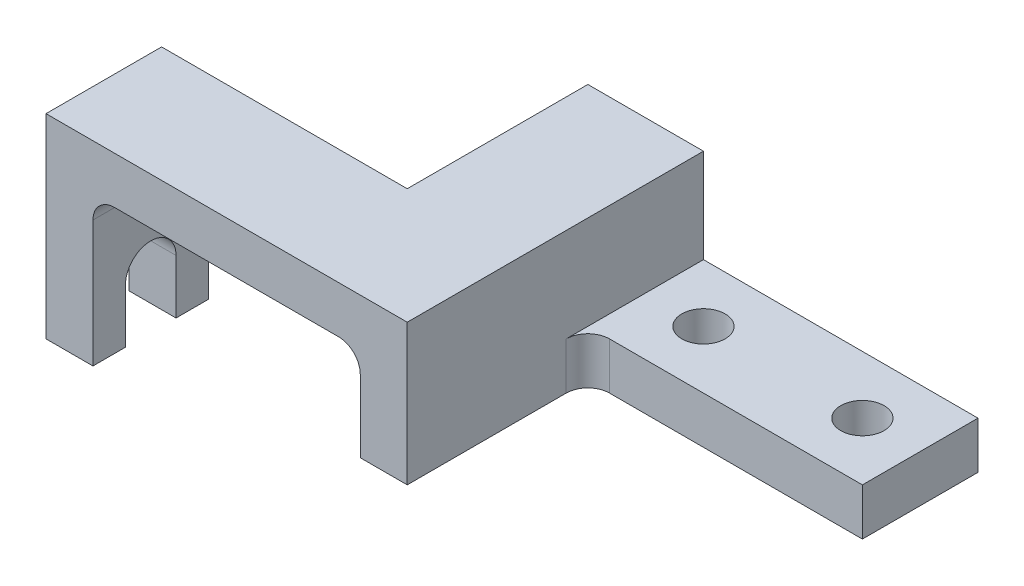
ISO-10303-21;
HEADER;
FILE_DESCRIPTION(('STEP AP214'),'2;1');
FILE_NAME('part.step','',(''),(''),'','','');
FILE_SCHEMA(('AUTOMOTIVE_DESIGN { 1 0 10303 214 1 1 1 1 }'));
ENDSEC;
DATA;
#1=APPLICATION_CONTEXT('core data for automotive mechanical design processes');
#2=APPLICATION_PROTOCOL_DEFINITION('international standard','automotive_design',2000,#1);
#3=PRODUCT_CONTEXT('',#1,'mechanical');
#4=PRODUCT('Part','Part','',(#3));
#5=PRODUCT_RELATED_PRODUCT_CATEGORY('part','',(#4));
#6=PRODUCT_DEFINITION_FORMATION('','',#4);
#7=PRODUCT_DEFINITION_CONTEXT('part definition',#1,'design');
#8=PRODUCT_DEFINITION('design','',#6,#7);
#9=PRODUCT_DEFINITION_SHAPE('','',#8);
#10=(LENGTH_UNIT() NAMED_UNIT(*) SI_UNIT(.MILLI.,.METRE.));
#11=(NAMED_UNIT(*) PLANE_ANGLE_UNIT() SI_UNIT($,.RADIAN.));
#12=(NAMED_UNIT(*) SI_UNIT($,.STERADIAN.) SOLID_ANGLE_UNIT());
#13=UNCERTAINTY_MEASURE_WITH_UNIT(LENGTH_MEASURE(1.E-05),#10,'distance_accuracy_value','');
#14=(GEOMETRIC_REPRESENTATION_CONTEXT(3) GLOBAL_UNCERTAINTY_ASSIGNED_CONTEXT((#13)) GLOBAL_UNIT_ASSIGNED_CONTEXT((#10,
#11,#12)) REPRESENTATION_CONTEXT('',''));
#15=CARTESIAN_POINT('',(0.,0.,0.));
#16=DIRECTION('',(0.,0.,1.));
#17=DIRECTION('',(1.,0.,0.));
#18=AXIS2_PLACEMENT_3D('',#15,#16,#17);
#19=CARTESIAN_POINT('',(-138.,0.,0.));
#20=DIRECTION('',(-1.,0.,0.));
#21=DIRECTION('',(0.,0.,1.));
#22=AXIS2_PLACEMENT_3D('',#19,#20,#21);
#23=PLANE('',#22);
#24=CARTESIAN_POINT('',(-138.,0.,50.));
#25=DIRECTION('',(-1.,0.,0.));
#26=DIRECTION('',(0.,0.,1.));
#27=AXIS2_PLACEMENT_3D('',#24,#25,#26);
#28=CIRCLE('',#27,7.);
#29=CARTESIAN_POINT('',(-138.,0.,57.));
#30=VERTEX_POINT('',#29);
#31=CARTESIAN_POINT('',(-138.,0.,43.));
#32=VERTEX_POINT('',#31);
#33=EDGE_CURVE('E43',#30,#32,#28,.T.);
#34=ORIENTED_EDGE('',*,*,#33,.F.);
#35=DIRECTION('',(0.,-1.,0.));
#36=VECTOR('',#35,1.);
#37=CARTESIAN_POINT('',(-138.,0.,57.));
#38=LINE('',#37,#36);
#39=CARTESIAN_POINT('',(-138.,-15.,57.));
#40=VERTEX_POINT('',#39);
#41=EDGE_CURVE('E71',#30,#40,#38,.T.);
#42=ORIENTED_EDGE('',*,*,#41,.T.);
#43=DIRECTION('',(0.,0.,-1.));
#44=VECTOR('',#43,1.);
#45=CARTESIAN_POINT('',(-138.,-15.,66.));
#46=LINE('',#45,#44);
#47=CARTESIAN_POINT('',(-138.,-15.,66.));
#48=VERTEX_POINT('',#47);
#49=EDGE_CURVE('E322',#48,#40,#46,.T.);
#50=ORIENTED_EDGE('',*,*,#49,.F.);
#51=DIRECTION('',(0.,1.,0.));
#52=VECTOR('',#51,1.);
#53=CARTESIAN_POINT('',(-138.,39.,66.));
#54=LINE('',#53,#52);
#55=CARTESIAN_POINT('',(-138.,39.,66.));
#56=VERTEX_POINT('',#55);
#57=EDGE_CURVE('E290',#48,#56,#54,.T.);
#58=ORIENTED_EDGE('',*,*,#57,.T.);
#59=DIRECTION('',(0.,0.,-1.));
#60=VECTOR('',#59,1.);
#61=CARTESIAN_POINT('',(-138.,39.,-16.));
#62=LINE('',#61,#60);
#63=CARTESIAN_POINT('',(-138.,39.,34.));
#64=VERTEX_POINT('',#63);
#65=EDGE_CURVE('E287',#56,#64,#62,.T.);
#66=ORIENTED_EDGE('',*,*,#65,.T.);
#67=DIRECTION('',(0.,1.,0.));
#68=VECTOR('',#67,1.);
#69=CARTESIAN_POINT('',(-138.,0.,34.));
#70=LINE('',#69,#68);
#71=CARTESIAN_POINT('',(-138.,-15.,34.));
#72=VERTEX_POINT('',#71);
#73=EDGE_CURVE('E228',#72,#64,#70,.T.);
#74=ORIENTED_EDGE('',*,*,#73,.F.);
#75=CARTESIAN_POINT('',(-138.,-15.,43.));
#76=VERTEX_POINT('',#75);
#77=EDGE_CURVE('E325',#76,#72,#46,.T.);
#78=ORIENTED_EDGE('',*,*,#77,.F.);
#79=DIRECTION('',(0.,1.,0.));
#80=VECTOR('',#79,1.);
#81=CARTESIAN_POINT('',(-138.,0.,43.));
#82=LINE('',#81,#80);
#83=EDGE_CURVE('E57',#76,#32,#82,.T.);
#84=ORIENTED_EDGE('',*,*,#83,.T.);
#85=EDGE_LOOP('',(#34,#42,#50,#58,#66,#74,#78,#84));
#86=FACE_BOUND('',#85,.T.);
#87=ADVANCED_FACE('F39',(#86),#23,.T.);
#88=CARTESIAN_POINT('',(-125.,-15.,66.));
#89=DIRECTION('',(-1.,0.,0.));
#90=DIRECTION('',(0.,0.,1.));
#91=AXIS2_PLACEMENT_3D('',#88,#89,#90);
#92=PLANE('',#91);
#93=DIRECTION('',(0.,-1.,0.));
#94=VECTOR('',#93,1.);
#95=CARTESIAN_POINT('',(-125.,0.,57.));
#96=LINE('',#95,#94);
#97=CARTESIAN_POINT('',(-125.,0.,57.));
#98=VERTEX_POINT('',#97);
#99=CARTESIAN_POINT('',(-125.,-15.,57.));
#100=VERTEX_POINT('',#99);
#101=EDGE_CURVE('E328',#98,#100,#96,.T.);
#102=ORIENTED_EDGE('',*,*,#101,.F.);
#103=CARTESIAN_POINT('',(-125.,0.,50.));
#104=DIRECTION('',(-1.,0.,0.));
#105=DIRECTION('',(0.,0.,1.));
#106=AXIS2_PLACEMENT_3D('',#103,#104,#105);
#107=CIRCLE('',#106,7.);
#108=CARTESIAN_POINT('',(-125.,0.,43.));
#109=VERTEX_POINT('',#108);
#110=EDGE_CURVE('E337',#109,#98,#107,.F.);
#111=ORIENTED_EDGE('',*,*,#110,.F.);
#112=DIRECTION('',(0.,1.,0.));
#113=VECTOR('',#112,1.);
#114=CARTESIAN_POINT('',(-125.,0.,43.));
#115=LINE('',#114,#113);
#116=CARTESIAN_POINT('',(-125.,-15.,43.));
#117=VERTEX_POINT('',#116);
#118=EDGE_CURVE('E333',#117,#109,#115,.T.);
#119=ORIENTED_EDGE('',*,*,#118,.F.);
#120=DIRECTION('',(0.,0.,1.));
#121=VECTOR('',#120,1.);
#122=CARTESIAN_POINT('',(-125.,-15.,66.));
#123=LINE('',#122,#121);
#124=CARTESIAN_POINT('',(-125.,-15.,34.));
#125=VERTEX_POINT('',#124);
#126=EDGE_CURVE('E316',#125,#117,#123,.T.);
#127=ORIENTED_EDGE('',*,*,#126,.F.);
#128=DIRECTION('',(0.,1.,0.));
#129=VECTOR('',#128,1.);
#130=CARTESIAN_POINT('',(-125.,-15.,34.));
#131=LINE('',#130,#129);
#132=CARTESIAN_POINT('',(-125.,20.,34.));
#133=VERTEX_POINT('',#132);
#134=EDGE_CURVE('E305',#125,#133,#131,.T.);
#135=ORIENTED_EDGE('',*,*,#134,.T.);
#136=DIRECTION('',(0.,0.,1.));
#137=VECTOR('',#136,1.);
#138=CARTESIAN_POINT('',(-125.,20.,66.));
#139=LINE('',#138,#137);
#140=CARTESIAN_POINT('',(-125.,20.,66.));
#141=VERTEX_POINT('',#140);
#142=EDGE_CURVE('E216',#133,#141,#139,.T.);
#143=ORIENTED_EDGE('',*,*,#142,.T.);
#144=DIRECTION('',(0.,1.,0.));
#145=VECTOR('',#144,1.);
#146=CARTESIAN_POINT('',(-125.,-15.,66.));
#147=LINE('',#146,#145);
#148=CARTESIAN_POINT('',(-125.,-15.,66.));
#149=VERTEX_POINT('',#148);
#150=EDGE_CURVE('E310',#149,#141,#147,.T.);
#151=ORIENTED_EDGE('',*,*,#150,.F.);
#152=EDGE_CURVE('E319',#100,#149,#123,.T.);
#153=ORIENTED_EDGE('',*,*,#152,.F.);
#154=EDGE_LOOP('',(#102,#111,#119,#127,#135,#143,#151,#153));
#155=FACE_BOUND('',#154,.T.);
#156=ADVANCED_FACE('F347',(#155),#92,.F.);
#157=CARTESIAN_POINT('',(0.,-15.,0.));
#158=DIRECTION('',(0.,-1.,0.));
#159=DIRECTION('',(0.,0.,-1.));
#160=AXIS2_PLACEMENT_3D('',#157,#158,#159);
#161=PLANE('',#160);
#162=ORIENTED_EDGE('',*,*,#49,.T.);
#163=DIRECTION('',(1.,0.,0.));
#164=VECTOR('',#163,1.);
#165=CARTESIAN_POINT('',(0.,-15.,57.));
#166=LINE('',#165,#164);
#167=EDGE_CURVE('E11',#40,#100,#166,.T.);
#168=ORIENTED_EDGE('',*,*,#167,.T.);
#169=ORIENTED_EDGE('',*,*,#152,.T.);
#170=DIRECTION('',(-1.,0.,0.));
#171=VECTOR('',#170,1.);
#172=CARTESIAN_POINT('',(-138.,-15.,66.));
#173=LINE('',#172,#171);
#174=EDGE_CURVE('E313',#149,#48,#173,.T.);
#175=ORIENTED_EDGE('',*,*,#174,.T.);
#176=EDGE_LOOP('',(#162,#168,#169,#175));
#177=FACE_BOUND('',#176,.T.);
#178=ADVANCED_FACE('F353',(#177),#161,.T.);
#179=ORIENTED_EDGE('',*,*,#126,.T.);
#180=DIRECTION('',(-1.,0.,0.));
#181=VECTOR('',#180,1.);
#182=CARTESIAN_POINT('',(0.,-15.,43.));
#183=LINE('',#182,#181);
#184=EDGE_CURVE('E49',#117,#76,#183,.T.);
#185=ORIENTED_EDGE('',*,*,#184,.T.);
#186=ORIENTED_EDGE('',*,*,#77,.T.);
#187=DIRECTION('',(1.,0.,0.));
#188=VECTOR('',#187,1.);
#189=CARTESIAN_POINT('',(-138.,-15.,34.));
#190=LINE('',#189,#188);
#191=EDGE_CURVE('E320',#72,#125,#190,.T.);
#192=ORIENTED_EDGE('',*,*,#191,.T.);
#193=EDGE_LOOP('',(#179,#185,#186,#192));
#194=FACE_BOUND('',#193,.T.);
#195=ADVANCED_FACE('F361',(#194),#161,.T.);
#196=CARTESIAN_POINT('',(-138.,26.,-16.));
#197=DIRECTION('',(0.,1.,0.));
#198=DIRECTION('',(0.,0.,1.));
#199=AXIS2_PLACEMENT_3D('',#196,#197,#198);
#200=PLANE('',#199);
#201=DIRECTION('',(1.,0.,0.));
#202=VECTOR('',#201,1.);
#203=CARTESIAN_POINT('',(-138.,26.,66.));
#204=LINE('',#203,#202);
#205=CARTESIAN_POINT('',(-119.,26.,66.));
#206=VERTEX_POINT('',#205);
#207=CARTESIAN_POINT('',(-57.,26.,66.));
#208=VERTEX_POINT('',#207);
#209=EDGE_CURVE('E284',#206,#208,#204,.T.);
#210=ORIENTED_EDGE('',*,*,#209,.F.);
#211=DIRECTION('',(0.,0.,1.));
#212=VECTOR('',#211,1.);
#213=CARTESIAN_POINT('',(-119.,26.,34.));
#214=LINE('',#213,#212);
#215=CARTESIAN_POINT('',(-119.,26.,34.));
#216=VERTEX_POINT('',#215);
#217=EDGE_CURVE('E186',#206,#216,#214,.F.);
#218=ORIENTED_EDGE('',*,*,#217,.T.);
#219=DIRECTION('',(1.,0.,0.));
#220=VECTOR('',#219,1.);
#221=CARTESIAN_POINT('',(-138.,26.,34.));
#222=LINE('',#221,#220);
#223=CARTESIAN_POINT('',(-70.,26.,34.));
#224=VERTEX_POINT('',#223);
#225=EDGE_CURVE('E299',#216,#224,#222,.T.);
#226=ORIENTED_EDGE('',*,*,#225,.T.);
#227=DIRECTION('',(0.,0.,-1.));
#228=VECTOR('',#227,1.);
#229=CARTESIAN_POINT('',(-70.,26.,-16.));
#230=LINE('',#229,#228);
#231=CARTESIAN_POINT('',(-70.,26.,-16.));
#232=VERTEX_POINT('',#231);
#233=EDGE_CURVE('E225',#224,#232,#230,.T.);
#234=ORIENTED_EDGE('',*,*,#233,.T.);
#235=DIRECTION('',(1.,0.,0.));
#236=VECTOR('',#235,1.);
#237=CARTESIAN_POINT('',(-138.,26.,-16.));
#238=LINE('',#237,#236);
#239=CARTESIAN_POINT('',(-57.,26.,-16.));
#240=VERTEX_POINT('',#239);
#241=EDGE_CURVE('E280',#232,#240,#238,.T.);
#242=ORIENTED_EDGE('',*,*,#241,.T.);
#243=DIRECTION('',(0.,0.,1.));
#244=VECTOR('',#243,1.);
#245=CARTESIAN_POINT('',(-57.,26.,66.));
#246=LINE('',#245,#244);
#247=EDGE_CURVE('E201',#240,#208,#246,.T.);
#248=ORIENTED_EDGE('',*,*,#247,.T.);
#249=EDGE_LOOP('',(#210,#218,#226,#234,#242,#248));
#250=FACE_BOUND('',#249,.T.);
#251=ADVANCED_FACE('F390',(#250),#200,.F.);
#252=CARTESIAN_POINT('',(-51.,0.,0.));
#253=DIRECTION('',(1.,0.,0.));
#254=DIRECTION('',(0.,0.,-1.));
#255=AXIS2_PLACEMENT_3D('',#252,#253,#254);
#256=PLANE('',#255);
#257=DIRECTION('',(0.,1.,0.));
#258=VECTOR('',#257,1.);
#259=CARTESIAN_POINT('',(-51.,0.,66.));
#260=LINE('',#259,#258);
#261=CARTESIAN_POINT('',(-51.,0.,66.));
#262=VERTEX_POINT('',#261);
#263=CARTESIAN_POINT('',(-51.,20.,66.));
#264=VERTEX_POINT('',#263);
#265=EDGE_CURVE('E182',#262,#264,#260,.T.);
#266=ORIENTED_EDGE('',*,*,#265,.T.);
#267=DIRECTION('',(0.,0.,1.));
#268=VECTOR('',#267,1.);
#269=CARTESIAN_POINT('',(-51.,20.,-16.));
#270=LINE('',#269,#268);
#271=CARTESIAN_POINT('',(-51.,20.,-16.));
#272=VERTEX_POINT('',#271);
#273=EDGE_CURVE('E176',#264,#272,#270,.F.);
#274=ORIENTED_EDGE('',*,*,#273,.T.);
#275=DIRECTION('',(0.,-1.,0.));
#276=VECTOR('',#275,1.);
#277=CARTESIAN_POINT('',(-51.,0.,-16.));
#278=LINE('',#277,#276);
#279=CARTESIAN_POINT('',(-51.,0.,-16.));
#280=VERTEX_POINT('',#279);
#281=EDGE_CURVE('E179',#272,#280,#278,.T.);
#282=ORIENTED_EDGE('',*,*,#281,.T.);
#283=DIRECTION('',(0.,0.,1.));
#284=VECTOR('',#283,1.);
#285=CARTESIAN_POINT('',(-51.,0.,-16.));
#286=LINE('',#285,#284);
#287=EDGE_CURVE('E196',#280,#262,#286,.T.);
#288=ORIENTED_EDGE('',*,*,#287,.T.);
#289=EDGE_LOOP('',(#266,#274,#282,#288));
#290=FACE_BOUND('',#289,.T.);
#291=ADVANCED_FACE('F178',(#290),#256,.F.);
#292=CARTESIAN_POINT('',(38.,13.,16.));
#293=DIRECTION('',(-1.,0.,0.));
#294=DIRECTION('',(0.,0.,1.));
#295=AXIS2_PLACEMENT_3D('',#292,#293,#294);
#296=PLANE('',#295);
#297=DIRECTION('',(0.,0.,-1.));
#298=VECTOR('',#297,1.);
#299=CARTESIAN_POINT('',(38.,0.,16.));
#300=LINE('',#299,#298);
#301=CARTESIAN_POINT('',(38.,0.,16.));
#302=VERTEX_POINT('',#301);
#303=CARTESIAN_POINT('',(38.,0.,-16.));
#304=VERTEX_POINT('',#303);
#305=EDGE_CURVE('E240',#302,#304,#300,.T.);
#306=ORIENTED_EDGE('',*,*,#305,.T.);
#307=DIRECTION('',(0.,-1.,0.));
#308=VECTOR('',#307,1.);
#309=CARTESIAN_POINT('',(38.,13.,-16.));
#310=LINE('',#309,#308);
#311=CARTESIAN_POINT('',(38.,13.,-16.));
#312=VERTEX_POINT('',#311);
#313=EDGE_CURVE('E230',#312,#304,#310,.T.);
#314=ORIENTED_EDGE('',*,*,#313,.F.);
#315=DIRECTION('',(0.,0.,-1.));
#316=VECTOR('',#315,1.);
#317=CARTESIAN_POINT('',(38.,13.,16.));
#318=LINE('',#317,#316);
#319=CARTESIAN_POINT('',(38.,13.,16.));
#320=VERTEX_POINT('',#319);
#321=EDGE_CURVE('E238',#320,#312,#318,.T.);
#322=ORIENTED_EDGE('',*,*,#321,.F.);
#323=DIRECTION('',(0.,-1.,0.));
#324=VECTOR('',#323,1.);
#325=CARTESIAN_POINT('',(38.,13.,16.));
#326=LINE('',#325,#324);
#327=EDGE_CURVE('E232',#320,#302,#326,.T.);
#328=ORIENTED_EDGE('',*,*,#327,.T.);
#329=EDGE_LOOP('',(#306,#314,#322,#328));
#330=FACE_BOUND('',#329,.T.);
#331=ADVANCED_FACE('F396',(#330),#296,.F.);
#332=CARTESIAN_POINT('',(-38.,13.,-16.));
#333=DIRECTION('',(0.,0.,1.));
#334=DIRECTION('',(1.,0.,0.));
#335=AXIS2_PLACEMENT_3D('',#332,#333,#334);
#336=PLANE('',#335);
#337=ORIENTED_EDGE('',*,*,#241,.F.);
#338=DIRECTION('',(0.,1.,0.));
#339=VECTOR('',#338,1.);
#340=CARTESIAN_POINT('',(-70.,0.,-16.));
#341=LINE('',#340,#339);
#342=CARTESIAN_POINT('',(-70.,39.,-16.));
#343=VERTEX_POINT('',#342);
#344=EDGE_CURVE('E301',#232,#343,#341,.T.);
#345=ORIENTED_EDGE('',*,*,#344,.T.);
#346=DIRECTION('',(1.,0.,0.));
#347=VECTOR('',#346,1.);
#348=CARTESIAN_POINT('',(-51.,39.,-16.));
#349=LINE('',#348,#347);
#350=CARTESIAN_POINT('',(-38.,39.,-16.));
#351=VERTEX_POINT('',#350);
#352=EDGE_CURVE('E269',#343,#351,#349,.T.);
#353=ORIENTED_EDGE('',*,*,#352,.T.);
#354=DIRECTION('',(0.,-1.,0.));
#355=VECTOR('',#354,1.);
#356=CARTESIAN_POINT('',(-38.,0.,-16.));
#357=LINE('',#356,#355);
#358=CARTESIAN_POINT('',(-38.,13.,-16.));
#359=VERTEX_POINT('',#358);
#360=EDGE_CURVE('E277',#351,#359,#357,.T.);
#361=ORIENTED_EDGE('',*,*,#360,.T.);
#362=DIRECTION('',(-1.,0.,0.));
#363=VECTOR('',#362,1.);
#364=CARTESIAN_POINT('',(-38.,13.,-16.));
#365=LINE('',#364,#363);
#366=EDGE_CURVE('E247',#312,#359,#365,.T.);
#367=ORIENTED_EDGE('',*,*,#366,.F.);
#368=ORIENTED_EDGE('',*,*,#313,.T.);
#369=DIRECTION('',(-1.,0.,0.));
#370=VECTOR('',#369,1.);
#371=CARTESIAN_POINT('',(-38.,0.,-16.));
#372=LINE('',#371,#370);
#373=EDGE_CURVE('E194',#304,#280,#372,.T.);
#374=ORIENTED_EDGE('',*,*,#373,.T.);
#375=ORIENTED_EDGE('',*,*,#281,.F.);
#376=CARTESIAN_POINT('',(-57.,20.,-16.));
#377=DIRECTION('',(0.,0.,1.));
#378=DIRECTION('',(1.,0.,0.));
#379=AXIS2_PLACEMENT_3D('',#376,#377,#378);
#380=CIRCLE('',#379,6.);
#381=EDGE_CURVE('E191',#272,#240,#380,.T.);
#382=ORIENTED_EDGE('',*,*,#381,.T.);
#383=EDGE_LOOP('',(#337,#345,#353,#361,#367,#368,#374,#375,#382));
#384=FACE_BOUND('',#383,.T.);
#385=ADVANCED_FACE('F190',(#384),#336,.F.);
#386=CARTESIAN_POINT('',(-38.,13.,16.));
#387=DIRECTION('',(0.,0.,-1.));
#388=DIRECTION('',(-1.,0.,0.));
#389=AXIS2_PLACEMENT_3D('',#386,#387,#388);
#390=PLANE('',#389);
#391=DIRECTION('',(1.,0.,0.));
#392=VECTOR('',#391,1.);
#393=CARTESIAN_POINT('',(-38.,13.,16.));
#394=LINE('',#393,#392);
#395=CARTESIAN_POINT('',(-32.,13.,16.));
#396=VERTEX_POINT('',#395);
#397=EDGE_CURVE('E235',#396,#320,#394,.T.);
#398=ORIENTED_EDGE('',*,*,#397,.F.);
#399=DIRECTION('',(0.,-1.,0.));
#400=VECTOR('',#399,1.);
#401=CARTESIAN_POINT('',(-32.,13.,16.));
#402=LINE('',#401,#400);
#403=CARTESIAN_POINT('',(-32.,0.,16.));
#404=VERTEX_POINT('',#403);
#405=EDGE_CURVE('E222',#396,#404,#402,.T.);
#406=ORIENTED_EDGE('',*,*,#405,.T.);
#407=DIRECTION('',(1.,0.,0.));
#408=VECTOR('',#407,1.);
#409=CARTESIAN_POINT('',(-38.,0.,16.));
#410=LINE('',#409,#408);
#411=EDGE_CURVE('E236',#404,#302,#410,.T.);
#412=ORIENTED_EDGE('',*,*,#411,.T.);
#413=ORIENTED_EDGE('',*,*,#327,.F.);
#414=EDGE_LOOP('',(#398,#406,#412,#413));
#415=FACE_BOUND('',#414,.T.);
#416=ADVANCED_FACE('F422',(#415),#390,.F.);
#417=CARTESIAN_POINT('',(0.,13.,0.));
#418=DIRECTION('',(0.,-1.,0.));
#419=DIRECTION('',(0.,0.,-1.));
#420=AXIS2_PLACEMENT_3D('',#417,#418,#419);
#421=PLANE('',#420);
#422=CARTESIAN_POINT('',(-22.,13.,0.));
#423=DIRECTION('',(0.,-1.,0.));
#424=DIRECTION('',(0.,0.,-1.));
#425=AXIS2_PLACEMENT_3D('',#422,#423,#424);
#426=CIRCLE('',#425,6.);
#427=CARTESIAN_POINT('',(-22.,13.,-6.));
#428=VERTEX_POINT('',#427);
#429=EDGE_CURVE('E243',#428,#428,#426,.T.);
#430=ORIENTED_EDGE('',*,*,#429,.T.);
#431=EDGE_LOOP('',(#430));
#432=FACE_BOUND('',#431,.T.);
#433=CARTESIAN_POINT('',(22.,13.,0.));
#434=DIRECTION('',(0.,-1.,0.));
#435=DIRECTION('',(0.,0.,-1.));
#436=AXIS2_PLACEMENT_3D('',#433,#434,#435);
#437=CIRCLE('',#436,6.);
#438=CARTESIAN_POINT('',(22.,13.,-6.));
#439=VERTEX_POINT('',#438);
#440=EDGE_CURVE('E254',#439,#439,#437,.T.);
#441=ORIENTED_EDGE('',*,*,#440,.T.);
#442=EDGE_LOOP('',(#441));
#443=FACE_BOUND('',#442,.T.);
#444=ORIENTED_EDGE('',*,*,#321,.T.);
#445=ORIENTED_EDGE('',*,*,#366,.T.);
#446=DIRECTION('',(0.,0.,1.));
#447=VECTOR('',#446,1.);
#448=CARTESIAN_POINT('',(-38.,13.,16.));
#449=LINE('',#448,#447);
#450=CARTESIAN_POINT('',(-38.,13.,22.));
#451=VERTEX_POINT('',#450);
#452=EDGE_CURVE('E245',#359,#451,#449,.T.);
#453=ORIENTED_EDGE('',*,*,#452,.T.);
#454=CARTESIAN_POINT('',(-32.,13.,22.));
#455=DIRECTION('',(0.,-1.,0.));
#456=DIRECTION('',(0.,0.,-1.));
#457=AXIS2_PLACEMENT_3D('',#454,#455,#456);
#458=CIRCLE('',#457,6.);
#459=EDGE_CURVE('E211',#451,#396,#458,.T.);
#460=ORIENTED_EDGE('',*,*,#459,.T.);
#461=ORIENTED_EDGE('',*,*,#397,.T.);
#462=EDGE_LOOP('',(#444,#445,#453,#460,#461));
#463=FACE_BOUND('',#462,.T.);
#464=ADVANCED_FACE('F419',(#432,#443,#463),#421,.F.);
#465=CARTESIAN_POINT('',(0.,0.,0.));
#466=DIRECTION('',(0.,-1.,0.));
#467=DIRECTION('',(0.,0.,-1.));
#468=AXIS2_PLACEMENT_3D('',#465,#466,#467);
#469=PLANE('',#468);
#470=CARTESIAN_POINT('',(-22.,0.,0.));
#471=DIRECTION('',(0.,1.,0.));
#472=DIRECTION('',(0.,0.,1.));
#473=AXIS2_PLACEMENT_3D('',#470,#471,#472);
#474=CIRCLE('',#473,6.);
#475=CARTESIAN_POINT('',(-22.,0.,6.));
#476=VERTEX_POINT('',#475);
#477=EDGE_CURVE('E257',#476,#476,#474,.T.);
#478=ORIENTED_EDGE('',*,*,#477,.T.);
#479=EDGE_LOOP('',(#478));
#480=FACE_BOUND('',#479,.T.);
#481=CARTESIAN_POINT('',(22.,0.,0.));
#482=DIRECTION('',(0.,1.,0.));
#483=DIRECTION('',(0.,0.,1.));
#484=AXIS2_PLACEMENT_3D('',#481,#482,#483);
#485=CIRCLE('',#484,6.);
#486=CARTESIAN_POINT('',(22.,0.,6.));
#487=VERTEX_POINT('',#486);
#488=EDGE_CURVE('E258',#487,#487,#485,.T.);
#489=ORIENTED_EDGE('',*,*,#488,.T.);
#490=EDGE_LOOP('',(#489));
#491=FACE_BOUND('',#490,.T.);
#492=ORIENTED_EDGE('',*,*,#305,.F.);
#493=ORIENTED_EDGE('',*,*,#411,.F.);
#494=CARTESIAN_POINT('',(-32.,0.,22.));
#495=DIRECTION('',(0.,-1.,0.));
#496=DIRECTION('',(0.,0.,-1.));
#497=AXIS2_PLACEMENT_3D('',#494,#495,#496);
#498=CIRCLE('',#497,6.);
#499=CARTESIAN_POINT('',(-38.,0.,22.));
#500=VERTEX_POINT('',#499);
#501=EDGE_CURVE('E185',#404,#500,#498,.F.);
#502=ORIENTED_EDGE('',*,*,#501,.T.);
#503=DIRECTION('',(0.,0.,1.));
#504=VECTOR('',#503,1.);
#505=CARTESIAN_POINT('',(-38.,0.,-16.));
#506=LINE('',#505,#504);
#507=CARTESIAN_POINT('',(-38.,0.,66.));
#508=VERTEX_POINT('',#507);
#509=EDGE_CURVE('E275',#500,#508,#506,.T.);
#510=ORIENTED_EDGE('',*,*,#509,.T.);
#511=DIRECTION('',(1.,0.,0.));
#512=VECTOR('',#511,1.);
#513=CARTESIAN_POINT('',(-51.,0.,66.));
#514=LINE('',#513,#512);
#515=EDGE_CURVE('E261',#262,#508,#514,.T.);
#516=ORIENTED_EDGE('',*,*,#515,.F.);
#517=ORIENTED_EDGE('',*,*,#287,.F.);
#518=ORIENTED_EDGE('',*,*,#373,.F.);
#519=EDGE_LOOP('',(#492,#493,#502,#510,#516,#517,#518));
#520=FACE_BOUND('',#519,.T.);
#521=ADVANCED_FACE('F417',(#480,#491,#520),#469,.T.);
#522=CARTESIAN_POINT('',(22.,0.,0.));
#523=DIRECTION('',(0.,1.,0.));
#524=DIRECTION('',(0.,0.,1.));
#525=AXIS2_PLACEMENT_3D('',#522,#523,#524);
#526=CYLINDRICAL_SURFACE('',#525,6.);
#527=ORIENTED_EDGE('',*,*,#488,.F.);
#528=EDGE_LOOP('',(#527));
#529=FACE_BOUND('',#528,.T.);
#530=ORIENTED_EDGE('',*,*,#440,.F.);
#531=EDGE_LOOP('',(#530));
#532=FACE_BOUND('',#531,.T.);
#533=ADVANCED_FACE('F413',(#529,#532),#526,.F.);
#534=CARTESIAN_POINT('',(-22.,0.,0.));
#535=DIRECTION('',(0.,1.,0.));
#536=DIRECTION('',(0.,0.,1.));
#537=AXIS2_PLACEMENT_3D('',#534,#535,#536);
#538=CYLINDRICAL_SURFACE('',#537,6.);
#539=ORIENTED_EDGE('',*,*,#477,.F.);
#540=EDGE_LOOP('',(#539));
#541=FACE_BOUND('',#540,.T.);
#542=ORIENTED_EDGE('',*,*,#429,.F.);
#543=EDGE_LOOP('',(#542));
#544=FACE_BOUND('',#543,.T.);
#545=ADVANCED_FACE('F401',(#541,#544),#538,.F.);
#546=CARTESIAN_POINT('',(-38.,0.,0.));
#547=DIRECTION('',(1.,0.,0.));
#548=DIRECTION('',(0.,0.,-1.));
#549=AXIS2_PLACEMENT_3D('',#546,#547,#548);
#550=PLANE('',#549);
#551=ORIENTED_EDGE('',*,*,#509,.F.);
#552=DIRECTION('',(0.,-1.,0.));
#553=VECTOR('',#552,1.);
#554=CARTESIAN_POINT('',(-38.,0.,22.));
#555=LINE('',#554,#553);
#556=EDGE_CURVE('E219',#500,#451,#555,.F.);
#557=ORIENTED_EDGE('',*,*,#556,.T.);
#558=ORIENTED_EDGE('',*,*,#452,.F.);
#559=ORIENTED_EDGE('',*,*,#360,.F.);
#560=DIRECTION('',(0.,0.,-1.));
#561=VECTOR('',#560,1.);
#562=CARTESIAN_POINT('',(-38.,39.,-16.));
#563=LINE('',#562,#561);
#564=CARTESIAN_POINT('',(-38.,39.,66.));
#565=VERTEX_POINT('',#564);
#566=EDGE_CURVE('E197',#565,#351,#563,.T.);
#567=ORIENTED_EDGE('',*,*,#566,.F.);
#568=DIRECTION('',(0.,1.,0.));
#569=VECTOR('',#568,1.);
#570=CARTESIAN_POINT('',(-38.,0.,66.));
#571=LINE('',#570,#569);
#572=EDGE_CURVE('E273',#508,#565,#571,.T.);
#573=ORIENTED_EDGE('',*,*,#572,.F.);
#574=EDGE_LOOP('',(#551,#557,#558,#559,#567,#573));
#575=FACE_BOUND('',#574,.T.);
#576=ADVANCED_FACE('F397',(#575),#550,.T.);
#577=CARTESIAN_POINT('',(-51.,0.,66.));
#578=DIRECTION('',(0.,0.,-1.));
#579=DIRECTION('',(-1.,0.,0.));
#580=AXIS2_PLACEMENT_3D('',#577,#578,#579);
#581=PLANE('',#580);
#582=ORIENTED_EDGE('',*,*,#572,.T.);
#583=DIRECTION('',(1.,0.,0.));
#584=VECTOR('',#583,1.);
#585=CARTESIAN_POINT('',(-51.,39.,66.));
#586=LINE('',#585,#584);
#587=EDGE_CURVE('E266',#56,#565,#586,.T.);
#588=ORIENTED_EDGE('',*,*,#587,.F.);
#589=ORIENTED_EDGE('',*,*,#57,.F.);
#590=ORIENTED_EDGE('',*,*,#174,.F.);
#591=ORIENTED_EDGE('',*,*,#150,.T.);
#592=CARTESIAN_POINT('',(-119.,20.,66.));
#593=DIRECTION('',(0.,0.,-1.));
#594=DIRECTION('',(-1.,0.,0.));
#595=AXIS2_PLACEMENT_3D('',#592,#593,#594);
#596=CIRCLE('',#595,6.);
#597=EDGE_CURVE('E209',#141,#206,#596,.T.);
#598=ORIENTED_EDGE('',*,*,#597,.T.);
#599=ORIENTED_EDGE('',*,*,#209,.T.);
#600=CARTESIAN_POINT('',(-57.,20.,66.));
#601=DIRECTION('',(0.,0.,-1.));
#602=DIRECTION('',(-1.,0.,0.));
#603=AXIS2_PLACEMENT_3D('',#600,#601,#602);
#604=CIRCLE('',#603,6.);
#605=EDGE_CURVE('E202',#208,#264,#604,.T.);
#606=ORIENTED_EDGE('',*,*,#605,.T.);
#607=ORIENTED_EDGE('',*,*,#265,.F.);
#608=ORIENTED_EDGE('',*,*,#515,.T.);
#609=EDGE_LOOP('',(#582,#588,#589,#590,#591,#598,#599,#606,#607,#608));
#610=FACE_BOUND('',#609,.T.);
#611=ADVANCED_FACE('F400',(#610),#581,.F.);
#612=CARTESIAN_POINT('',(-51.,39.,-16.));
#613=DIRECTION('',(0.,-1.,0.));
#614=DIRECTION('',(0.,0.,-1.));
#615=AXIS2_PLACEMENT_3D('',#612,#613,#614);
#616=PLANE('',#615);
#617=DIRECTION('',(0.,0.,1.));
#618=VECTOR('',#617,1.);
#619=CARTESIAN_POINT('',(-70.,39.,-16.));
#620=LINE('',#619,#618);
#621=CARTESIAN_POINT('',(-70.,39.,34.));
#622=VERTEX_POINT('',#621);
#623=EDGE_CURVE('E293',#343,#622,#620,.T.);
#624=ORIENTED_EDGE('',*,*,#623,.T.);
#625=DIRECTION('',(-1.,0.,0.));
#626=VECTOR('',#625,1.);
#627=CARTESIAN_POINT('',(-51.,39.,34.));
#628=LINE('',#627,#626);
#629=EDGE_CURVE('E296',#622,#64,#628,.T.);
#630=ORIENTED_EDGE('',*,*,#629,.T.);
#631=ORIENTED_EDGE('',*,*,#65,.F.);
#632=ORIENTED_EDGE('',*,*,#587,.T.);
#633=ORIENTED_EDGE('',*,*,#566,.T.);
#634=ORIENTED_EDGE('',*,*,#352,.F.);
#635=EDGE_LOOP('',(#624,#630,#631,#632,#633,#634));
#636=FACE_BOUND('',#635,.T.);
#637=ADVANCED_FACE('F403',(#636),#616,.F.);
#638=CARTESIAN_POINT('',(-70.,0.,0.));
#639=DIRECTION('',(1.,0.,0.));
#640=DIRECTION('',(0.,0.,-1.));
#641=AXIS2_PLACEMENT_3D('',#638,#639,#640);
#642=PLANE('',#641);
#643=ORIENTED_EDGE('',*,*,#344,.F.);
#644=ORIENTED_EDGE('',*,*,#233,.F.);
#645=DIRECTION('',(0.,1.,0.));
#646=VECTOR('',#645,1.);
#647=CARTESIAN_POINT('',(-70.,0.,34.));
#648=LINE('',#647,#646);
#649=EDGE_CURVE('E302',#224,#622,#648,.T.);
#650=ORIENTED_EDGE('',*,*,#649,.T.);
#651=ORIENTED_EDGE('',*,*,#623,.F.);
#652=EDGE_LOOP('',(#643,#644,#650,#651));
#653=FACE_BOUND('',#652,.T.);
#654=ADVANCED_FACE('F406',(#653),#642,.F.);
#655=CARTESIAN_POINT('',(0.,0.,34.));
#656=DIRECTION('',(0.,0.,1.));
#657=DIRECTION('',(1.,0.,0.));
#658=AXIS2_PLACEMENT_3D('',#655,#656,#657);
#659=PLANE('',#658);
#660=ORIENTED_EDGE('',*,*,#649,.F.);
#661=ORIENTED_EDGE('',*,*,#225,.F.);
#662=CARTESIAN_POINT('',(-119.,20.,34.));
#663=DIRECTION('',(0.,0.,1.));
#664=DIRECTION('',(1.,0.,0.));
#665=AXIS2_PLACEMENT_3D('',#662,#663,#664);
#666=CIRCLE('',#665,6.);
#667=EDGE_CURVE('E205',#216,#133,#666,.T.);
#668=ORIENTED_EDGE('',*,*,#667,.T.);
#669=ORIENTED_EDGE('',*,*,#134,.F.);
#670=ORIENTED_EDGE('',*,*,#191,.F.);
#671=ORIENTED_EDGE('',*,*,#73,.T.);
#672=ORIENTED_EDGE('',*,*,#629,.F.);
#673=EDGE_LOOP('',(#660,#661,#668,#669,#670,#671,#672));
#674=FACE_BOUND('',#673,.T.);
#675=ADVANCED_FACE('F366',(#674),#659,.F.);
#676=CARTESIAN_POINT('',(-32.,13.,22.));
#677=DIRECTION('',(0.,-1.,0.));
#678=DIRECTION('',(0.,0.,-1.));
#679=AXIS2_PLACEMENT_3D('',#676,#677,#678);
#680=CYLINDRICAL_SURFACE('',#679,6.);
#681=ORIENTED_EDGE('',*,*,#459,.F.);
#682=ORIENTED_EDGE('',*,*,#556,.F.);
#683=ORIENTED_EDGE('',*,*,#501,.F.);
#684=ORIENTED_EDGE('',*,*,#405,.F.);
#685=EDGE_LOOP('',(#681,#682,#683,#684));
#686=FACE_BOUND('',#685,.T.);
#687=ADVANCED_FACE('F435',(#686),#680,.F.);
#688=CARTESIAN_POINT('',(-119.,20.,66.));
#689=DIRECTION('',(0.,0.,-1.));
#690=DIRECTION('',(-1.,0.,0.));
#691=AXIS2_PLACEMENT_3D('',#688,#689,#690);
#692=CYLINDRICAL_SURFACE('',#691,6.);
#693=ORIENTED_EDGE('',*,*,#667,.F.);
#694=ORIENTED_EDGE('',*,*,#217,.F.);
#695=ORIENTED_EDGE('',*,*,#597,.F.);
#696=ORIENTED_EDGE('',*,*,#142,.F.);
#697=EDGE_LOOP('',(#693,#694,#695,#696));
#698=FACE_BOUND('',#697,.T.);
#699=ADVANCED_FACE('F437',(#698),#692,.F.);
#700=CARTESIAN_POINT('',(-57.,20.,-16.));
#701=DIRECTION('',(0.,0.,-1.));
#702=DIRECTION('',(-1.,0.,0.));
#703=AXIS2_PLACEMENT_3D('',#700,#701,#702);
#704=CYLINDRICAL_SURFACE('',#703,6.);
#705=ORIENTED_EDGE('',*,*,#381,.F.);
#706=ORIENTED_EDGE('',*,*,#273,.F.);
#707=ORIENTED_EDGE('',*,*,#605,.F.);
#708=ORIENTED_EDGE('',*,*,#247,.F.);
#709=EDGE_LOOP('',(#705,#706,#707,#708));
#710=FACE_BOUND('',#709,.T.);
#711=ADVANCED_FACE('F41',(#710),#704,.F.);
#712=CARTESIAN_POINT('',(-138.000012,0.,57.));
#713=DIRECTION('',(0.,0.,-1.));
#714=DIRECTION('',(0.,1.,0.));
#715=AXIS2_PLACEMENT_3D('',#712,#713,#714);
#716=PLANE('',#715);
#717=DIRECTION('',(-1.,0.,0.));
#718=VECTOR('',#717,1.);
#719=CARTESIAN_POINT('',(38.001,0.,57.));
#720=LINE('',#719,#718);
#721=EDGE_CURVE('E331',#98,#30,#720,.T.);
#722=ORIENTED_EDGE('',*,*,#721,.F.);
#723=ORIENTED_EDGE('',*,*,#101,.T.);
#724=ORIENTED_EDGE('',*,*,#167,.F.);
#725=ORIENTED_EDGE('',*,*,#41,.F.);
#726=EDGE_LOOP('',(#722,#723,#724,#725));
#727=FACE_BOUND('',#726,.T.);
#728=ADVANCED_FACE('F350',(#727),#716,.T.);
#729=CARTESIAN_POINT('',(-138.000012,0.,43.));
#730=DIRECTION('',(0.,0.,1.));
#731=DIRECTION('',(1.,0.,0.));
#732=AXIS2_PLACEMENT_3D('',#729,#730,#731);
#733=PLANE('',#732);
#734=ORIENTED_EDGE('',*,*,#184,.F.);
#735=ORIENTED_EDGE('',*,*,#118,.T.);
#736=DIRECTION('',(-1.,0.,0.));
#737=VECTOR('',#736,1.);
#738=CARTESIAN_POINT('',(38.001,0.,43.));
#739=LINE('',#738,#737);
#740=EDGE_CURVE('E329',#109,#32,#739,.T.);
#741=ORIENTED_EDGE('',*,*,#740,.T.);
#742=ORIENTED_EDGE('',*,*,#83,.F.);
#743=EDGE_LOOP('',(#734,#735,#741,#742));
#744=FACE_BOUND('',#743,.T.);
#745=ADVANCED_FACE('F371',(#744),#733,.T.);
#746=CARTESIAN_POINT('',(38.001,0.,50.));
#747=DIRECTION('',(-1.,0.,0.));
#748=DIRECTION('',(0.,0.,1.));
#749=AXIS2_PLACEMENT_3D('',#746,#747,#748);
#750=CYLINDRICAL_SURFACE('',#749,7.);
#751=ORIENTED_EDGE('',*,*,#33,.T.);
#752=ORIENTED_EDGE('',*,*,#740,.F.);
#753=ORIENTED_EDGE('',*,*,#110,.T.);
#754=ORIENTED_EDGE('',*,*,#721,.T.);
#755=EDGE_LOOP('',(#751,#752,#753,#754));
#756=FACE_BOUND('',#755,.T.);
#757=ADVANCED_FACE('F343',(#756),#750,.F.);
#758=CLOSED_SHELL('',(#87,#156,#178,#195,#251,#291,#331,#385,#416,#464,#521,#533,#545,#576,#611,
#637,#654,#675,#687,#699,#711,#728,#745,#757));
#759=MANIFOLD_SOLID_BREP('B2',#758);
#760=ADVANCED_BREP_SHAPE_REPRESENTATION('',(#18,#759),#14);
#761=SHAPE_DEFINITION_REPRESENTATION(#9,#760);
ENDSEC;
END-ISO-10303-21;
